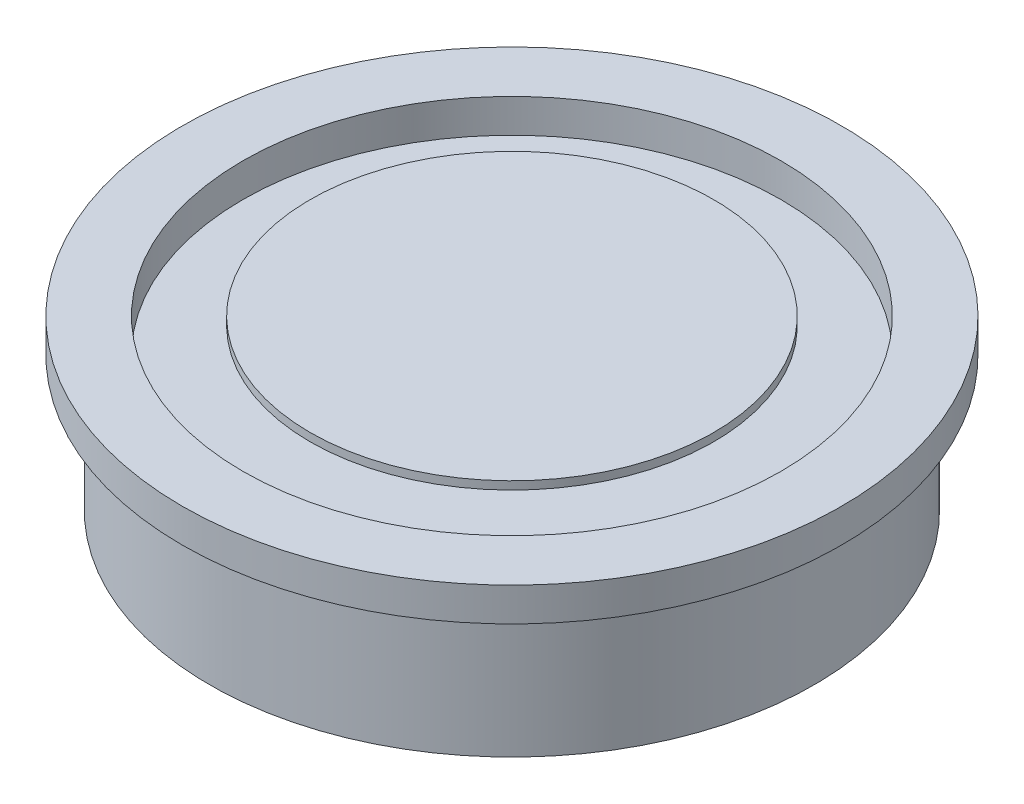
ISO-10303-21;
HEADER;
FILE_DESCRIPTION(('STEP AP214'),'2;1');
FILE_NAME('part.step','',(''),(''),'','','');
FILE_SCHEMA(('AUTOMOTIVE_DESIGN { 1 0 10303 214 1 1 1 1 }'));
ENDSEC;
DATA;
#1=APPLICATION_CONTEXT('core data for automotive mechanical design processes');
#2=APPLICATION_PROTOCOL_DEFINITION('international standard','automotive_design',2000,#1);
#3=PRODUCT_CONTEXT('',#1,'mechanical');
#4=PRODUCT('Part','Part','',(#3));
#5=PRODUCT_RELATED_PRODUCT_CATEGORY('part','',(#4));
#6=PRODUCT_DEFINITION_FORMATION('','',#4);
#7=PRODUCT_DEFINITION_CONTEXT('part definition',#1,'design');
#8=PRODUCT_DEFINITION('design','',#6,#7);
#9=PRODUCT_DEFINITION_SHAPE('','',#8);
#10=(LENGTH_UNIT() NAMED_UNIT(*) SI_UNIT(.MILLI.,.METRE.));
#11=(NAMED_UNIT(*) PLANE_ANGLE_UNIT() SI_UNIT($,.RADIAN.));
#12=(NAMED_UNIT(*) SI_UNIT($,.STERADIAN.) SOLID_ANGLE_UNIT());
#13=UNCERTAINTY_MEASURE_WITH_UNIT(LENGTH_MEASURE(1.E-05),#10,'distance_accuracy_value','');
#14=(GEOMETRIC_REPRESENTATION_CONTEXT(3) GLOBAL_UNCERTAINTY_ASSIGNED_CONTEXT((#13)) GLOBAL_UNIT_ASSIGNED_CONTEXT((#10,
#11,#12)) REPRESENTATION_CONTEXT('',''));
#15=CARTESIAN_POINT('',(0.,0.,0.));
#16=DIRECTION('',(0.,0.,1.));
#17=DIRECTION('',(1.,0.,0.));
#18=AXIS2_PLACEMENT_3D('',#15,#16,#17);
#19=CARTESIAN_POINT('',(0.,7.9375,0.));
#20=DIRECTION('',(0.,-1.,0.));
#21=DIRECTION('',(0.,0.,-1.));
#22=AXIS2_PLACEMENT_3D('',#19,#20,#21);
#23=CYLINDRICAL_SURFACE('',#22,9.525);
#24=CARTESIAN_POINT('',(0.,7.9375,0.));
#25=DIRECTION('',(0.,-1.,0.));
#26=DIRECTION('',(0.,0.,1.));
#27=AXIS2_PLACEMENT_3D('',#24,#25,#26);
#28=CIRCLE('',#27,9.525);
#29=CARTESIAN_POINT('',(0.,7.9375,9.525));
#30=VERTEX_POINT('',#29);
#31=EDGE_CURVE('E11',#30,#30,#28,.T.);
#32=ORIENTED_EDGE('',*,*,#31,.T.);
#33=EDGE_LOOP('',(#32));
#34=FACE_BOUND('',#33,.T.);
#35=CARTESIAN_POINT('',(0.,7.5565,0.));
#36=DIRECTION('',(0.,-1.,0.));
#37=DIRECTION('',(0.,0.,1.));
#38=AXIS2_PLACEMENT_3D('',#35,#36,#37);
#39=CIRCLE('',#38,9.525);
#40=CARTESIAN_POINT('',(0.,7.5565,9.525));
#41=VERTEX_POINT('',#40);
#42=EDGE_CURVE('E44',#41,#41,#39,.T.);
#43=ORIENTED_EDGE('',*,*,#42,.F.);
#44=EDGE_LOOP('',(#43));
#45=FACE_BOUND('',#44,.T.);
#46=ADVANCED_FACE('F41',(#34,#45),#23,.T.);
#47=CARTESIAN_POINT('',(0.,7.9375,0.));
#48=DIRECTION('',(0.,1.,0.));
#49=DIRECTION('',(0.,0.,1.));
#50=AXIS2_PLACEMENT_3D('',#47,#48,#49);
#51=PLANE('',#50);
#52=ORIENTED_EDGE('',*,*,#31,.F.);
#53=EDGE_LOOP('',(#52));
#54=FACE_BOUND('',#53,.T.);
#55=ADVANCED_FACE('F56',(#54),#51,.T.);
#56=CARTESIAN_POINT('',(0.,7.5565,0.));
#57=DIRECTION('',(0.,1.,0.));
#58=DIRECTION('',(0.,0.,1.));
#59=AXIS2_PLACEMENT_3D('',#56,#57,#58);
#60=PLANE('',#59);
#61=ORIENTED_EDGE('',*,*,#42,.T.);
#62=EDGE_LOOP('',(#61));
#63=FACE_BOUND('',#62,.T.);
#64=ADVANCED_FACE('F53',(#63),#60,.F.);
#65=CLOSED_SHELL('',(#46,#55,#64));
#66=MANIFOLD_SOLID_BREP('B2',#65);
#67=CARTESIAN_POINT('',(15.5575,6.35,0.));
#68=DIRECTION('',(0.,-1.,0.));
#69=DIRECTION('',(0.,0.,-1.));
#70=AXIS2_PLACEMENT_3D('',#67,#68,#69);
#71=PLANE('',#70);
#72=CARTESIAN_POINT('',(0.,6.35,0.));
#73=DIRECTION('',(0.,1.,0.));
#74=DIRECTION('',(0.,0.,1.));
#75=AXIS2_PLACEMENT_3D('',#72,#73,#74);
#76=CIRCLE('',#75,15.5575);
#77=CARTESIAN_POINT('',(0.,6.35,15.5575));
#78=VERTEX_POINT('',#77);
#79=EDGE_CURVE('E39',#78,#78,#76,.T.);
#80=ORIENTED_EDGE('',*,*,#79,.F.);
#81=EDGE_LOOP('',(#80));
#82=FACE_BOUND('',#81,.T.);
#83=CARTESIAN_POINT('',(0.,6.35,0.));
#84=DIRECTION('',(0.,-1.,0.));
#85=DIRECTION('',(0.,0.,-1.));
#86=AXIS2_PLACEMENT_3D('',#83,#84,#85);
#87=CIRCLE('',#86,14.2748);
#88=CARTESIAN_POINT('',(0.,6.35,-14.2748));
#89=VERTEX_POINT('',#88);
#90=EDGE_CURVE('E149',#89,#89,#87,.T.);
#91=ORIENTED_EDGE('',*,*,#90,.F.);
#92=EDGE_LOOP('',(#91));
#93=FACE_BOUND('',#92,.T.);
#94=ADVANCED_FACE('F82',(#82,#93),#71,.T.);
#95=CARTESIAN_POINT('',(0.,6.35,0.));
#96=DIRECTION('',(0.,1.,0.));
#97=DIRECTION('',(0.,0.,1.));
#98=AXIS2_PLACEMENT_3D('',#95,#96,#97);
#99=CYLINDRICAL_SURFACE('',#98,15.5575);
#100=ORIENTED_EDGE('',*,*,#79,.T.);
#101=EDGE_LOOP('',(#100));
#102=FACE_BOUND('',#101,.T.);
#103=CARTESIAN_POINT('',(0.,7.9375,0.));
#104=DIRECTION('',(0.,1.,0.));
#105=DIRECTION('',(0.,0.,1.));
#106=AXIS2_PLACEMENT_3D('',#103,#104,#105);
#107=CIRCLE('',#106,15.5575);
#108=CARTESIAN_POINT('',(0.,7.9375,15.5575));
#109=VERTEX_POINT('',#108);
#110=EDGE_CURVE('E90',#109,#109,#107,.T.);
#111=ORIENTED_EDGE('',*,*,#110,.F.);
#112=EDGE_LOOP('',(#111));
#113=FACE_BOUND('',#112,.T.);
#114=ADVANCED_FACE('F84',(#102,#113),#99,.T.);
#115=CARTESIAN_POINT('',(0.,7.9375,0.));
#116=DIRECTION('',(0.,1.,0.));
#117=DIRECTION('',(0.,0.,1.));
#118=AXIS2_PLACEMENT_3D('',#115,#116,#117);
#119=PLANE('',#118);
#120=CARTESIAN_POINT('',(0.,7.9375,0.));
#121=DIRECTION('',(0.,1.,0.));
#122=DIRECTION('',(0.,0.,1.));
#123=AXIS2_PLACEMENT_3D('',#120,#121,#122);
#124=CIRCLE('',#123,12.7);
#125=CARTESIAN_POINT('',(0.,7.9375,12.7));
#126=VERTEX_POINT('',#125);
#127=EDGE_CURVE('E187',#126,#126,#124,.T.);
#128=ORIENTED_EDGE('',*,*,#127,.F.);
#129=EDGE_LOOP('',(#128));
#130=FACE_BOUND('',#129,.T.);
#131=ORIENTED_EDGE('',*,*,#110,.T.);
#132=EDGE_LOOP('',(#131));
#133=FACE_BOUND('',#132,.T.);
#134=ADVANCED_FACE('F197',(#130,#133),#119,.T.);
#135=CARTESIAN_POINT('',(0.,7.9375,0.));
#136=DIRECTION('',(0.,1.,0.));
#137=DIRECTION('',(0.,0.,1.));
#138=AXIS2_PLACEMENT_3D('',#135,#136,#137);
#139=CYLINDRICAL_SURFACE('',#138,12.7);
#140=CARTESIAN_POINT('',(0.,6.34999999999999,0.));
#141=DIRECTION('',(0.,1.,0.));
#142=DIRECTION('',(0.,0.,1.));
#143=AXIS2_PLACEMENT_3D('',#140,#141,#142);
#144=CIRCLE('',#143,12.7);
#145=CARTESIAN_POINT('',(0.,6.34999999999999,12.7));
#146=VERTEX_POINT('',#145);
#147=EDGE_CURVE('E192',#146,#146,#144,.T.);
#148=ORIENTED_EDGE('',*,*,#147,.F.);
#149=EDGE_LOOP('',(#148));
#150=FACE_BOUND('',#149,.T.);
#151=ORIENTED_EDGE('',*,*,#127,.T.);
#152=EDGE_LOOP('',(#151));
#153=FACE_BOUND('',#152,.T.);
#154=ADVANCED_FACE('F205',(#150,#153),#139,.F.);
#155=CARTESIAN_POINT('',(0.,6.35,0.));
#156=DIRECTION('',(0.,-1.,0.));
#157=DIRECTION('',(0.,0.,-1.));
#158=AXIS2_PLACEMENT_3D('',#155,#156,#157);
#159=PLANE('',#158);
#160=DIRECTION('',(0.5,0.,-0.866025403784439));
#161=VECTOR('',#160,1.);
#162=CARTESIAN_POINT('',(7.34389542409204,6.35,0.));
#163=LINE('',#162,#161);
#164=CARTESIAN_POINT('',(3.67194771204602,6.35,6.36));
#165=VERTEX_POINT('',#164);
#166=CARTESIAN_POINT('',(7.34389542409204,6.35,0.));
#167=VERTEX_POINT('',#166);
#168=EDGE_CURVE('E156',#165,#167,#163,.T.);
#169=ORIENTED_EDGE('',*,*,#168,.F.);
#170=DIRECTION('',(1.,0.,0.));
#171=VECTOR('',#170,1.);
#172=CARTESIAN_POINT('',(3.67194771204602,6.35,6.36));
#173=LINE('',#172,#171);
#174=CARTESIAN_POINT('',(-3.67194771204601,6.35,6.36));
#175=VERTEX_POINT('',#174);
#176=EDGE_CURVE('E137',#175,#165,#173,.T.);
#177=ORIENTED_EDGE('',*,*,#176,.F.);
#178=DIRECTION('',(0.5,0.,0.866025403784439));
#179=VECTOR('',#178,1.);
#180=CARTESIAN_POINT('',(-3.67194771204601,6.35,6.36));
#181=LINE('',#180,#179);
#182=CARTESIAN_POINT('',(-7.34389542409204,6.35,0.));
#183=VERTEX_POINT('',#182);
#184=EDGE_CURVE('E146',#183,#175,#181,.T.);
#185=ORIENTED_EDGE('',*,*,#184,.F.);
#186=DIRECTION('',(-0.5,0.,0.866025403784439));
#187=VECTOR('',#186,1.);
#188=CARTESIAN_POINT('',(-7.34389542409204,6.35,0.));
#189=LINE('',#188,#187);
#190=CARTESIAN_POINT('',(-3.67194771204602,6.35,-6.36));
#191=VERTEX_POINT('',#190);
#192=EDGE_CURVE('E97',#191,#183,#189,.T.);
#193=ORIENTED_EDGE('',*,*,#192,.F.);
#194=DIRECTION('',(-1.,0.,0.));
#195=VECTOR('',#194,1.);
#196=CARTESIAN_POINT('',(-3.67194771204602,6.35,-6.36));
#197=LINE('',#196,#195);
#198=CARTESIAN_POINT('',(3.67194771204602,6.35,-6.36));
#199=VERTEX_POINT('',#198);
#200=EDGE_CURVE('E311',#199,#191,#197,.T.);
#201=ORIENTED_EDGE('',*,*,#200,.F.);
#202=DIRECTION('',(-0.5,0.,-0.866025403784439));
#203=VECTOR('',#202,1.);
#204=CARTESIAN_POINT('',(3.67194771204602,6.35,-6.36));
#205=LINE('',#204,#203);
#206=EDGE_CURVE('E160',#167,#199,#205,.T.);
#207=ORIENTED_EDGE('',*,*,#206,.F.);
#208=EDGE_LOOP('',(#169,#177,#185,#193,#201,#207));
#209=FACE_BOUND('',#208,.T.);
#210=ORIENTED_EDGE('',*,*,#147,.T.);
#211=EDGE_LOOP('',(#210));
#212=FACE_BOUND('',#211,.T.);
#213=ADVANCED_FACE('F152',(#209,#212),#159,.F.);
#214=CARTESIAN_POINT('',(0.,0.,0.));
#215=DIRECTION('',(0.,1.,0.));
#216=DIRECTION('',(0.,0.,1.));
#217=AXIS2_PLACEMENT_3D('',#214,#215,#216);
#218=CYLINDRICAL_SURFACE('',#217,14.2748);
#219=CARTESIAN_POINT('',(0.,0.,0.));
#220=DIRECTION('',(0.,-1.,0.));
#221=DIRECTION('',(0.,0.,-1.));
#222=AXIS2_PLACEMENT_3D('',#219,#220,#221);
#223=CIRCLE('',#222,14.2748);
#224=CARTESIAN_POINT('',(0.,0.,-14.2748));
#225=VERTEX_POINT('',#224);
#226=EDGE_CURVE('E184',#225,#225,#223,.T.);
#227=ORIENTED_EDGE('',*,*,#226,.F.);
#228=EDGE_LOOP('',(#227));
#229=FACE_BOUND('',#228,.T.);
#230=ORIENTED_EDGE('',*,*,#90,.T.);
#231=EDGE_LOOP('',(#230));
#232=FACE_BOUND('',#231,.T.);
#233=ADVANCED_FACE('F213',(#229,#232),#218,.T.);
#234=CARTESIAN_POINT('',(0.,0.,0.));
#235=DIRECTION('',(0.,-1.,0.));
#236=DIRECTION('',(0.,0.,-1.));
#237=AXIS2_PLACEMENT_3D('',#234,#235,#236);
#238=PLANE('',#237);
#239=DIRECTION('',(-1.,0.,0.));
#240=VECTOR('',#239,1.);
#241=CARTESIAN_POINT('',(3.67194771204602,0.,6.36));
#242=LINE('',#241,#240);
#243=CARTESIAN_POINT('',(3.67194771204602,0.,6.36));
#244=VERTEX_POINT('',#243);
#245=CARTESIAN_POINT('',(-3.67194771204601,0.,6.36));
#246=VERTEX_POINT('',#245);
#247=EDGE_CURVE('E105',#244,#246,#242,.T.);
#248=ORIENTED_EDGE('',*,*,#247,.F.);
#249=DIRECTION('',(-0.5,0.,0.866025403784439));
#250=VECTOR('',#249,1.);
#251=CARTESIAN_POINT('',(7.34389542409204,0.,0.));
#252=LINE('',#251,#250);
#253=CARTESIAN_POINT('',(7.34389542409204,0.,0.));
#254=VERTEX_POINT('',#253);
#255=EDGE_CURVE('E143',#254,#244,#252,.T.);
#256=ORIENTED_EDGE('',*,*,#255,.F.);
#257=DIRECTION('',(0.5,0.,0.866025403784438));
#258=VECTOR('',#257,1.);
#259=CARTESIAN_POINT('',(3.67194771204602,0.,-6.36));
#260=LINE('',#259,#258);
#261=CARTESIAN_POINT('',(3.67194771204602,0.,-6.36));
#262=VERTEX_POINT('',#261);
#263=EDGE_CURVE('E171',#262,#254,#260,.T.);
#264=ORIENTED_EDGE('',*,*,#263,.F.);
#265=DIRECTION('',(1.,0.,0.));
#266=VECTOR('',#265,1.);
#267=CARTESIAN_POINT('',(-3.67194771204602,0.,-6.36));
#268=LINE('',#267,#266);
#269=CARTESIAN_POINT('',(-3.67194771204602,0.,-6.36));
#270=VERTEX_POINT('',#269);
#271=EDGE_CURVE('E168',#270,#262,#268,.T.);
#272=ORIENTED_EDGE('',*,*,#271,.F.);
#273=DIRECTION('',(0.5,0.,-0.866025403784439));
#274=VECTOR('',#273,1.);
#275=CARTESIAN_POINT('',(-7.34389542409204,0.,0.));
#276=LINE('',#275,#274);
#277=CARTESIAN_POINT('',(-7.34389542409204,0.,0.));
#278=VERTEX_POINT('',#277);
#279=EDGE_CURVE('E165',#278,#270,#276,.T.);
#280=ORIENTED_EDGE('',*,*,#279,.F.);
#281=DIRECTION('',(-0.5,0.,-0.866025403784439));
#282=VECTOR('',#281,1.);
#283=CARTESIAN_POINT('',(-3.67194771204601,0.,6.36));
#284=LINE('',#283,#282);
#285=EDGE_CURVE('E158',#246,#278,#284,.T.);
#286=ORIENTED_EDGE('',*,*,#285,.F.);
#287=EDGE_LOOP('',(#248,#256,#264,#272,#280,#286));
#288=FACE_BOUND('',#287,.T.);
#289=ORIENTED_EDGE('',*,*,#226,.T.);
#290=EDGE_LOOP('',(#289));
#291=FACE_BOUND('',#290,.T.);
#292=ADVANCED_FACE('F215',(#288,#291),#238,.T.);
#293=CARTESIAN_POINT('',(3.67194771204602,7.9385,6.36));
#294=DIRECTION('',(0.,0.,1.));
#295=DIRECTION('',(1.,0.,0.));
#296=AXIS2_PLACEMENT_3D('',#293,#294,#295);
#297=PLANE('',#296);
#298=ORIENTED_EDGE('',*,*,#176,.T.);
#299=DIRECTION('',(0.,-1.,0.));
#300=VECTOR('',#299,1.);
#301=CARTESIAN_POINT('',(3.67194771204602,7.9385,6.36));
#302=LINE('',#301,#300);
#303=EDGE_CURVE('E150',#165,#244,#302,.T.);
#304=ORIENTED_EDGE('',*,*,#303,.T.);
#305=ORIENTED_EDGE('',*,*,#247,.T.);
#306=DIRECTION('',(0.,-1.,0.));
#307=VECTOR('',#306,1.);
#308=CARTESIAN_POINT('',(-3.67194771204601,7.9385,6.36));
#309=LINE('',#308,#307);
#310=EDGE_CURVE('E133',#175,#246,#309,.T.);
#311=ORIENTED_EDGE('',*,*,#310,.F.);
#312=EDGE_LOOP('',(#298,#304,#305,#311));
#313=FACE_BOUND('',#312,.T.);
#314=ADVANCED_FACE('F135',(#313),#297,.F.);
#315=CARTESIAN_POINT('',(7.34389542409204,7.9385,0.));
#316=DIRECTION('',(0.866025403784439,0.,0.5));
#317=DIRECTION('',(0.5,0.,-0.866025403784439));
#318=AXIS2_PLACEMENT_3D('',#315,#316,#317);
#319=PLANE('',#318);
#320=ORIENTED_EDGE('',*,*,#168,.T.);
#321=DIRECTION('',(0.,-1.,0.));
#322=VECTOR('',#321,1.);
#323=CARTESIAN_POINT('',(7.34389542409204,7.9385,0.));
#324=LINE('',#323,#322);
#325=EDGE_CURVE('E177',#167,#254,#324,.T.);
#326=ORIENTED_EDGE('',*,*,#325,.T.);
#327=ORIENTED_EDGE('',*,*,#255,.T.);
#328=ORIENTED_EDGE('',*,*,#303,.F.);
#329=EDGE_LOOP('',(#320,#326,#327,#328));
#330=FACE_BOUND('',#329,.T.);
#331=ADVANCED_FACE('F259',(#330),#319,.F.);
#332=CARTESIAN_POINT('',(3.67194771204602,7.9385,-6.36));
#333=DIRECTION('',(0.866025403784438,0.,-0.5));
#334=DIRECTION('',(-0.5,0.,-0.866025403784439));
#335=AXIS2_PLACEMENT_3D('',#332,#333,#334);
#336=PLANE('',#335);
#337=ORIENTED_EDGE('',*,*,#206,.T.);
#338=DIRECTION('',(0.,-1.,0.));
#339=VECTOR('',#338,1.);
#340=CARTESIAN_POINT('',(3.67194771204602,7.9385,-6.36));
#341=LINE('',#340,#339);
#342=EDGE_CURVE('E179',#199,#262,#341,.T.);
#343=ORIENTED_EDGE('',*,*,#342,.T.);
#344=ORIENTED_EDGE('',*,*,#263,.T.);
#345=ORIENTED_EDGE('',*,*,#325,.F.);
#346=EDGE_LOOP('',(#337,#343,#344,#345));
#347=FACE_BOUND('',#346,.T.);
#348=ADVANCED_FACE('F268',(#347),#336,.F.);
#349=CARTESIAN_POINT('',(-3.67194771204602,7.9385,-6.36));
#350=DIRECTION('',(0.,0.,-1.));
#351=DIRECTION('',(-1.,0.,0.));
#352=AXIS2_PLACEMENT_3D('',#349,#350,#351);
#353=PLANE('',#352);
#354=ORIENTED_EDGE('',*,*,#200,.T.);
#355=DIRECTION('',(0.,-1.,0.));
#356=VECTOR('',#355,1.);
#357=CARTESIAN_POINT('',(-3.67194771204602,7.9385,-6.36));
#358=LINE('',#357,#356);
#359=EDGE_CURVE('E181',#191,#270,#358,.T.);
#360=ORIENTED_EDGE('',*,*,#359,.T.);
#361=ORIENTED_EDGE('',*,*,#271,.T.);
#362=ORIENTED_EDGE('',*,*,#342,.F.);
#363=EDGE_LOOP('',(#354,#360,#361,#362));
#364=FACE_BOUND('',#363,.T.);
#365=ADVANCED_FACE('F278',(#364),#353,.F.);
#366=CARTESIAN_POINT('',(-7.34389542409204,7.9385,0.));
#367=DIRECTION('',(-0.866025403784439,0.,-0.5));
#368=DIRECTION('',(-0.5,0.,0.866025403784439));
#369=AXIS2_PLACEMENT_3D('',#366,#367,#368);
#370=PLANE('',#369);
#371=ORIENTED_EDGE('',*,*,#192,.T.);
#372=DIRECTION('',(0.,-1.,0.));
#373=VECTOR('',#372,1.);
#374=CARTESIAN_POINT('',(-7.34389542409204,7.9385,0.));
#375=LINE('',#374,#373);
#376=EDGE_CURVE('E142',#183,#278,#375,.T.);
#377=ORIENTED_EDGE('',*,*,#376,.T.);
#378=ORIENTED_EDGE('',*,*,#279,.T.);
#379=ORIENTED_EDGE('',*,*,#359,.F.);
#380=EDGE_LOOP('',(#371,#377,#378,#379));
#381=FACE_BOUND('',#380,.T.);
#382=ADVANCED_FACE('F288',(#381),#370,.F.);
#383=CARTESIAN_POINT('',(-3.67194771204601,7.9385,6.36));
#384=DIRECTION('',(-0.866025403784438,0.,0.5));
#385=DIRECTION('',(0.5,0.,0.866025403784439));
#386=AXIS2_PLACEMENT_3D('',#383,#384,#385);
#387=PLANE('',#386);
#388=ORIENTED_EDGE('',*,*,#184,.T.);
#389=ORIENTED_EDGE('',*,*,#310,.T.);
#390=ORIENTED_EDGE('',*,*,#285,.T.);
#391=ORIENTED_EDGE('',*,*,#376,.F.);
#392=EDGE_LOOP('',(#388,#389,#390,#391));
#393=FACE_BOUND('',#392,.T.);
#394=ADVANCED_FACE('F147',(#393),#387,.F.);
#395=CLOSED_SHELL('',(#94,#114,#134,#154,#213,#233,#292,#314,#331,#348,#365,#382,#394));
#396=MANIFOLD_SOLID_BREP('B6',#395);
#397=ADVANCED_BREP_SHAPE_REPRESENTATION('',(#18,#66,#396),#14);
#398=SHAPE_DEFINITION_REPRESENTATION(#9,#397);
ENDSEC;
END-ISO-10303-21;
